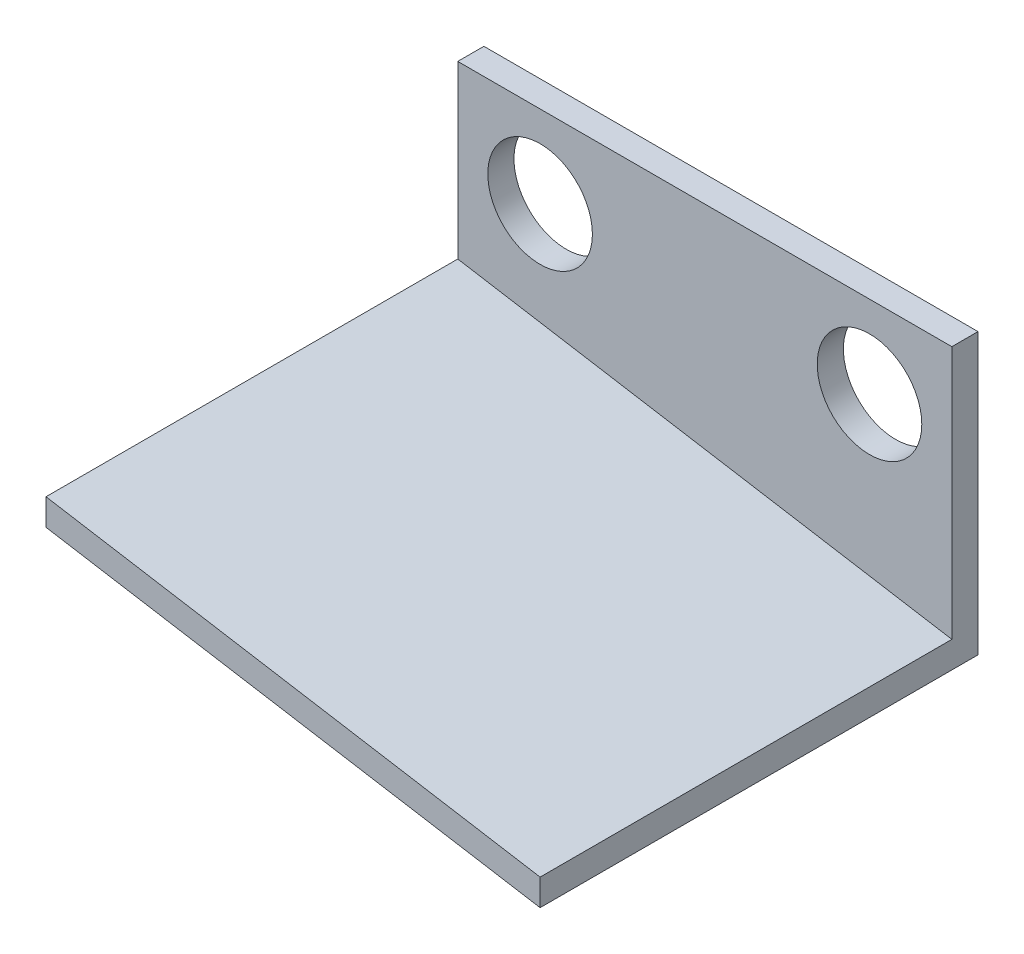
ISO-10303-21;
HEADER;
FILE_DESCRIPTION(('STEP AP214'),'2;1');
FILE_NAME('part.step','',(''),(''),'','','');
FILE_SCHEMA(('AUTOMOTIVE_DESIGN { 1 0 10303 214 1 1 1 1 }'));
ENDSEC;
DATA;
#1=APPLICATION_CONTEXT('core data for automotive mechanical design processes');
#2=APPLICATION_PROTOCOL_DEFINITION('international standard','automotive_design',2000,#1);
#3=PRODUCT_CONTEXT('',#1,'mechanical');
#4=PRODUCT('Part','Part','',(#3));
#5=PRODUCT_RELATED_PRODUCT_CATEGORY('part','',(#4));
#6=PRODUCT_DEFINITION_FORMATION('','',#4);
#7=PRODUCT_DEFINITION_CONTEXT('part definition',#1,'design');
#8=PRODUCT_DEFINITION('design','',#6,#7);
#9=PRODUCT_DEFINITION_SHAPE('','',#8);
#10=(LENGTH_UNIT() NAMED_UNIT(*) SI_UNIT(.MILLI.,.METRE.));
#11=(NAMED_UNIT(*) PLANE_ANGLE_UNIT() SI_UNIT($,.RADIAN.));
#12=(NAMED_UNIT(*) SI_UNIT($,.STERADIAN.) SOLID_ANGLE_UNIT());
#13=UNCERTAINTY_MEASURE_WITH_UNIT(LENGTH_MEASURE(1.E-05),#10,'distance_accuracy_value','');
#14=(GEOMETRIC_REPRESENTATION_CONTEXT(3) GLOBAL_UNCERTAINTY_ASSIGNED_CONTEXT((#13)) GLOBAL_UNIT_ASSIGNED_CONTEXT((#10,
#11,#12)) REPRESENTATION_CONTEXT('',''));
#15=CARTESIAN_POINT('',(0.,0.,0.));
#16=DIRECTION('',(0.,0.,1.));
#17=DIRECTION('',(1.,0.,0.));
#18=AXIS2_PLACEMENT_3D('',#15,#16,#17);
#19=CARTESIAN_POINT('',(-2.75675675675676,-16.5405405405405,1.5875));
#20=DIRECTION('',(-0.164398987305357,-0.986393923832144,0.));
#21=DIRECTION('',(0.986393923832144,-0.164398987305357,0.));
#22=AXIS2_PLACEMENT_3D('',#19,#20,#21);
#23=PLANE('',#22);
#24=DIRECTION('',(-0.986393923832144,0.164398987305357,0.));
#25=VECTOR('',#24,1.);
#26=CARTESIAN_POINT('',(-2.75675675675676,-16.5405405405405,0.));
#27=LINE('',#26,#25);
#28=CARTESIAN_POINT('',(0.,-17.,0.));
#29=VERTEX_POINT('',#28);
#30=CARTESIAN_POINT('',(-30.,-12.,0.));
#31=VERTEX_POINT('',#30);
#32=EDGE_CURVE('E86',#29,#31,#27,.T.);
#33=ORIENTED_EDGE('',*,*,#32,.F.);
#34=DIRECTION('',(0.,0.,-1.));
#35=VECTOR('',#34,1.);
#36=CARTESIAN_POINT('',(0.,-17.,1.5875));
#37=LINE('',#36,#35);
#38=CARTESIAN_POINT('',(0.,-17.,26.5875));
#39=VERTEX_POINT('',#38);
#40=EDGE_CURVE('E11',#39,#29,#37,.T.);
#41=ORIENTED_EDGE('',*,*,#40,.F.);
#42=DIRECTION('',(0.986393923832144,-0.164398987305357,0.));
#43=VECTOR('',#42,1.);
#44=CARTESIAN_POINT('',(-30.,-12.,26.5875));
#45=LINE('',#44,#43);
#46=CARTESIAN_POINT('',(-30.,-12.,26.5875));
#47=VERTEX_POINT('',#46);
#48=EDGE_CURVE('E90',#47,#39,#45,.T.);
#49=ORIENTED_EDGE('',*,*,#48,.F.);
#50=DIRECTION('',(0.,0.,-1.));
#51=VECTOR('',#50,1.);
#52=CARTESIAN_POINT('',(-30.,-12.,1.5875));
#53=LINE('',#52,#51);
#54=EDGE_CURVE('E82',#47,#31,#53,.T.);
#55=ORIENTED_EDGE('',*,*,#54,.T.);
#56=EDGE_LOOP('',(#33,#41,#49,#55));
#57=FACE_BOUND('',#56,.T.);
#58=ADVANCED_FACE('F41',(#57),#23,.T.);
#59=CARTESIAN_POINT('',(0.,0.,1.5875));
#60=DIRECTION('',(1.,0.,0.));
#61=DIRECTION('',(0.,0.,-1.));
#62=AXIS2_PLACEMENT_3D('',#59,#60,#61);
#63=PLANE('',#62);
#64=DIRECTION('',(0.,-1.,0.));
#65=VECTOR('',#64,1.);
#66=CARTESIAN_POINT('',(0.,0.,0.));
#67=LINE('',#66,#65);
#68=CARTESIAN_POINT('',(0.,0.,0.));
#69=VERTEX_POINT('',#68);
#70=EDGE_CURVE('E112',#69,#29,#67,.T.);
#71=ORIENTED_EDGE('',*,*,#70,.F.);
#72=DIRECTION('',(0.,0.,-1.));
#73=VECTOR('',#72,1.);
#74=CARTESIAN_POINT('',(0.,0.,1.5875));
#75=LINE('',#74,#73);
#76=CARTESIAN_POINT('',(0.,0.,1.5875));
#77=VERTEX_POINT('',#76);
#78=EDGE_CURVE('E49',#77,#69,#75,.T.);
#79=ORIENTED_EDGE('',*,*,#78,.F.);
#80=DIRECTION('',(0.,-1.,0.));
#81=VECTOR('',#80,1.);
#82=CARTESIAN_POINT('',(0.,0.,1.5875));
#83=LINE('',#82,#81);
#84=CARTESIAN_POINT('',(0.,-15.3906024138586,1.5875));
#85=VERTEX_POINT('',#84);
#86=EDGE_CURVE('E133',#77,#85,#83,.T.);
#87=ORIENTED_EDGE('',*,*,#86,.T.);
#88=DIRECTION('',(0.,0.,-1.));
#89=VECTOR('',#88,1.);
#90=CARTESIAN_POINT('',(0.,-15.3906024138586,26.5875));
#91=LINE('',#90,#89);
#92=CARTESIAN_POINT('',(0.,-15.3906024138586,26.5875));
#93=VERTEX_POINT('',#92);
#94=EDGE_CURVE('E114',#93,#85,#91,.T.);
#95=ORIENTED_EDGE('',*,*,#94,.F.);
#96=DIRECTION('',(0.,1.,0.));
#97=VECTOR('',#96,1.);
#98=CARTESIAN_POINT('',(0.,-17.,26.5875));
#99=LINE('',#98,#97);
#100=EDGE_CURVE('E145',#39,#93,#99,.T.);
#101=ORIENTED_EDGE('',*,*,#100,.F.);
#102=ORIENTED_EDGE('',*,*,#40,.T.);
#103=EDGE_LOOP('',(#71,#79,#87,#95,#101,#102));
#104=FACE_BOUND('',#103,.T.);
#105=ADVANCED_FACE('F140',(#104),#63,.T.);
#106=CARTESIAN_POINT('',(0.,0.,1.5875));
#107=DIRECTION('',(0.,-1.,0.));
#108=DIRECTION('',(1.,0.,0.));
#109=AXIS2_PLACEMENT_3D('',#106,#107,#108);
#110=PLANE('',#109);
#111=DIRECTION('',(-1.,0.,0.));
#112=VECTOR('',#111,1.);
#113=CARTESIAN_POINT('',(0.,0.,0.));
#114=LINE('',#113,#112);
#115=CARTESIAN_POINT('',(-30.,0.,0.));
#116=VERTEX_POINT('',#115);
#117=EDGE_CURVE('E107',#69,#116,#114,.T.);
#118=ORIENTED_EDGE('',*,*,#117,.T.);
#119=DIRECTION('',(0.,0.,-1.));
#120=VECTOR('',#119,1.);
#121=CARTESIAN_POINT('',(-30.,0.,1.5875));
#122=LINE('',#121,#120);
#123=CARTESIAN_POINT('',(-30.,0.,1.5875));
#124=VERTEX_POINT('',#123);
#125=EDGE_CURVE('E95',#124,#116,#122,.T.);
#126=ORIENTED_EDGE('',*,*,#125,.F.);
#127=DIRECTION('',(-1.,0.,0.));
#128=VECTOR('',#127,1.);
#129=CARTESIAN_POINT('',(0.,0.,1.5875));
#130=LINE('',#129,#128);
#131=EDGE_CURVE('E62',#77,#124,#130,.T.);
#132=ORIENTED_EDGE('',*,*,#131,.F.);
#133=ORIENTED_EDGE('',*,*,#78,.T.);
#134=EDGE_LOOP('',(#118,#126,#132,#133));
#135=FACE_BOUND('',#134,.T.);
#136=ADVANCED_FACE('F138',(#135),#110,.F.);
#137=CARTESIAN_POINT('',(-25.,-5.,1.5875));
#138=DIRECTION('',(0.,0.,-1.));
#139=DIRECTION('',(-1.,0.,0.));
#140=AXIS2_PLACEMENT_3D('',#137,#138,#139);
#141=CYLINDRICAL_SURFACE('',#140,3.175);
#142=CARTESIAN_POINT('',(-25.,-5.,1.5875));
#143=DIRECTION('',(0.,0.,1.));
#144=DIRECTION('',(1.,0.,0.));
#145=AXIS2_PLACEMENT_3D('',#142,#143,#144);
#146=CIRCLE('',#145,3.175);
#147=CARTESIAN_POINT('',(-21.825,-5.,1.5875));
#148=VERTEX_POINT('',#147);
#149=EDGE_CURVE('E173',#148,#148,#146,.T.);
#150=ORIENTED_EDGE('',*,*,#149,.T.);
#151=EDGE_LOOP('',(#150));
#152=FACE_BOUND('',#151,.T.);
#153=CARTESIAN_POINT('',(-25.,-5.,0.));
#154=DIRECTION('',(0.,0.,1.));
#155=DIRECTION('',(1.,0.,0.));
#156=AXIS2_PLACEMENT_3D('',#153,#154,#155);
#157=CIRCLE('',#156,3.175);
#158=CARTESIAN_POINT('',(-21.825,-5.,0.));
#159=VERTEX_POINT('',#158);
#160=EDGE_CURVE('E106',#159,#159,#157,.T.);
#161=ORIENTED_EDGE('',*,*,#160,.F.);
#162=EDGE_LOOP('',(#161));
#163=FACE_BOUND('',#162,.T.);
#164=ADVANCED_FACE('F204',(#152,#163),#141,.F.);
#165=CARTESIAN_POINT('',(-30.,0.,1.5875));
#166=DIRECTION('',(1.,0.,0.));
#167=DIRECTION('',(0.,0.,-1.));
#168=AXIS2_PLACEMENT_3D('',#165,#166,#167);
#169=PLANE('',#168);
#170=DIRECTION('',(0.,-1.,0.));
#171=VECTOR('',#170,1.);
#172=CARTESIAN_POINT('',(-30.,0.,0.));
#173=LINE('',#172,#171);
#174=EDGE_CURVE('E100',#116,#31,#173,.T.);
#175=ORIENTED_EDGE('',*,*,#174,.T.);
#176=ORIENTED_EDGE('',*,*,#54,.F.);
#177=DIRECTION('',(0.,-1.,0.));
#178=VECTOR('',#177,1.);
#179=CARTESIAN_POINT('',(-30.,-10.3906024138586,26.5875));
#180=LINE('',#179,#178);
#181=CARTESIAN_POINT('',(-30.,-10.3906024138586,26.5875));
#182=VERTEX_POINT('',#181);
#183=EDGE_CURVE('E151',#182,#47,#180,.T.);
#184=ORIENTED_EDGE('',*,*,#183,.F.);
#185=DIRECTION('',(0.,0.,-1.));
#186=VECTOR('',#185,1.);
#187=CARTESIAN_POINT('',(-30.,-10.3906024138586,26.5875));
#188=LINE('',#187,#186);
#189=CARTESIAN_POINT('',(-30.,-10.3906024138586,1.5875));
#190=VERTEX_POINT('',#189);
#191=EDGE_CURVE('E120',#182,#190,#188,.T.);
#192=ORIENTED_EDGE('',*,*,#191,.T.);
#193=DIRECTION('',(0.,-1.,0.));
#194=VECTOR('',#193,1.);
#195=CARTESIAN_POINT('',(-30.,0.,1.5875));
#196=LINE('',#195,#194);
#197=EDGE_CURVE('E171',#124,#190,#196,.T.);
#198=ORIENTED_EDGE('',*,*,#197,.F.);
#199=ORIENTED_EDGE('',*,*,#125,.T.);
#200=EDGE_LOOP('',(#175,#176,#184,#192,#198,#199));
#201=FACE_BOUND('',#200,.T.);
#202=ADVANCED_FACE('F101',(#201),#169,.F.);
#203=CARTESIAN_POINT('',(-5.,-5.,1.5875));
#204=DIRECTION('',(0.,0.,-1.));
#205=DIRECTION('',(-1.,0.,0.));
#206=AXIS2_PLACEMENT_3D('',#203,#204,#205);
#207=CYLINDRICAL_SURFACE('',#206,3.175);
#208=CARTESIAN_POINT('',(-5.,-5.,1.5875));
#209=DIRECTION('',(0.,0.,1.));
#210=DIRECTION('',(1.,0.,0.));
#211=AXIS2_PLACEMENT_3D('',#208,#209,#210);
#212=CIRCLE('',#211,3.175);
#213=CARTESIAN_POINT('',(-1.825,-5.,1.5875));
#214=VERTEX_POINT('',#213);
#215=EDGE_CURVE('E96',#214,#214,#212,.T.);
#216=ORIENTED_EDGE('',*,*,#215,.T.);
#217=EDGE_LOOP('',(#216));
#218=FACE_BOUND('',#217,.T.);
#219=CARTESIAN_POINT('',(-5.,-5.,0.));
#220=DIRECTION('',(0.,0.,1.));
#221=DIRECTION('',(1.,0.,0.));
#222=AXIS2_PLACEMENT_3D('',#219,#220,#221);
#223=CIRCLE('',#222,3.175);
#224=CARTESIAN_POINT('',(-1.825,-5.,0.));
#225=VERTEX_POINT('',#224);
#226=EDGE_CURVE('E130',#225,#225,#223,.T.);
#227=ORIENTED_EDGE('',*,*,#226,.F.);
#228=EDGE_LOOP('',(#227));
#229=FACE_BOUND('',#228,.T.);
#230=ADVANCED_FACE('F182',(#218,#229),#207,.F.);
#231=CARTESIAN_POINT('',(0.,0.,1.5875));
#232=DIRECTION('',(0.,0.,1.));
#233=DIRECTION('',(1.,0.,0.));
#234=AXIS2_PLACEMENT_3D('',#231,#232,#233);
#235=PLANE('',#234);
#236=DIRECTION('',(-0.986393923832144,0.164398987305357,0.));
#237=VECTOR('',#236,1.);
#238=CARTESIAN_POINT('',(0.,-15.3906024138586,1.5875));
#239=LINE('',#238,#237);
#240=EDGE_CURVE('E56',#85,#190,#239,.T.);
#241=ORIENTED_EDGE('',*,*,#240,.F.);
#242=ORIENTED_EDGE('',*,*,#86,.F.);
#243=ORIENTED_EDGE('',*,*,#131,.T.);
#244=ORIENTED_EDGE('',*,*,#197,.T.);
#245=EDGE_LOOP('',(#241,#242,#243,#244));
#246=FACE_BOUND('',#245,.T.);
#247=ORIENTED_EDGE('',*,*,#149,.F.);
#248=EDGE_LOOP('',(#247));
#249=FACE_BOUND('',#248,.T.);
#250=ORIENTED_EDGE('',*,*,#215,.F.);
#251=EDGE_LOOP('',(#250));
#252=FACE_BOUND('',#251,.T.);
#253=ADVANCED_FACE('F185',(#246,#249,#252),#235,.T.);
#254=CARTESIAN_POINT('',(0.,0.,0.));
#255=DIRECTION('',(0.,0.,1.));
#256=DIRECTION('',(1.,0.,0.));
#257=AXIS2_PLACEMENT_3D('',#254,#255,#256);
#258=PLANE('',#257);
#259=ORIENTED_EDGE('',*,*,#32,.T.);
#260=ORIENTED_EDGE('',*,*,#174,.F.);
#261=ORIENTED_EDGE('',*,*,#117,.F.);
#262=ORIENTED_EDGE('',*,*,#70,.T.);
#263=EDGE_LOOP('',(#259,#260,#261,#262));
#264=FACE_BOUND('',#263,.T.);
#265=ORIENTED_EDGE('',*,*,#160,.T.);
#266=EDGE_LOOP('',(#265));
#267=FACE_BOUND('',#266,.T.);
#268=ORIENTED_EDGE('',*,*,#226,.T.);
#269=EDGE_LOOP('',(#268));
#270=FACE_BOUND('',#269,.T.);
#271=ADVANCED_FACE('F109',(#264,#267,#270),#258,.F.);
#272=CARTESIAN_POINT('',(0.,-15.3906024138586,26.5875));
#273=DIRECTION('',(-0.164398987305357,-0.986393923832144,0.));
#274=DIRECTION('',(0.986393923832144,-0.164398987305357,0.));
#275=AXIS2_PLACEMENT_3D('',#272,#273,#274);
#276=PLANE('',#275);
#277=ORIENTED_EDGE('',*,*,#240,.T.);
#278=ORIENTED_EDGE('',*,*,#191,.F.);
#279=DIRECTION('',(-0.986393923832144,0.164398987305357,0.));
#280=VECTOR('',#279,1.);
#281=CARTESIAN_POINT('',(0.,-15.3906024138586,26.5875));
#282=LINE('',#281,#280);
#283=EDGE_CURVE('E156',#93,#182,#282,.T.);
#284=ORIENTED_EDGE('',*,*,#283,.F.);
#285=ORIENTED_EDGE('',*,*,#94,.T.);
#286=EDGE_LOOP('',(#277,#278,#284,#285));
#287=FACE_BOUND('',#286,.T.);
#288=ADVANCED_FACE('F192',(#287),#276,.F.);
#289=CARTESIAN_POINT('',(0.,0.,26.5875));
#290=DIRECTION('',(0.,0.,1.));
#291=DIRECTION('',(1.,0.,0.));
#292=AXIS2_PLACEMENT_3D('',#289,#290,#291);
#293=PLANE('',#292);
#294=ORIENTED_EDGE('',*,*,#183,.T.);
#295=ORIENTED_EDGE('',*,*,#48,.T.);
#296=ORIENTED_EDGE('',*,*,#100,.T.);
#297=ORIENTED_EDGE('',*,*,#283,.T.);
#298=EDGE_LOOP('',(#294,#295,#296,#297));
#299=FACE_BOUND('',#298,.T.);
#300=ADVANCED_FACE('F149',(#299),#293,.T.);
#301=CLOSED_SHELL('',(#58,#105,#136,#164,#202,#230,#253,#271,#288,#300));
#302=MANIFOLD_SOLID_BREP('B2',#301);
#303=ADVANCED_BREP_SHAPE_REPRESENTATION('',(#18,#302),#14);
#304=SHAPE_DEFINITION_REPRESENTATION(#9,#303);
ENDSEC;
END-ISO-10303-21;
